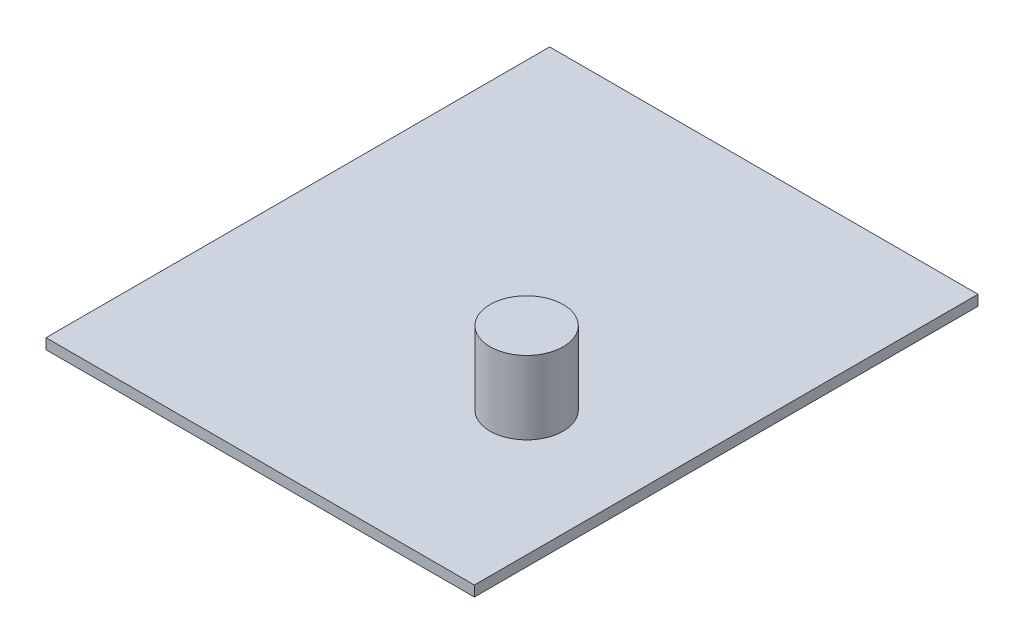
ISO-10303-21;
HEADER;
FILE_DESCRIPTION(('STEP AP214'),'2;1');
FILE_NAME('part.step','',(''),(''),'','','');
FILE_SCHEMA(('AUTOMOTIVE_DESIGN { 1 0 10303 214 1 1 1 1 }'));
ENDSEC;
DATA;
#1=APPLICATION_CONTEXT('core data for automotive mechanical design processes');
#2=APPLICATION_PROTOCOL_DEFINITION('international standard','automotive_design',2000,#1);
#3=PRODUCT_CONTEXT('',#1,'mechanical');
#4=PRODUCT('Part','Part','',(#3));
#5=PRODUCT_RELATED_PRODUCT_CATEGORY('part','',(#4));
#6=PRODUCT_DEFINITION_FORMATION('','',#4);
#7=PRODUCT_DEFINITION_CONTEXT('part definition',#1,'design');
#8=PRODUCT_DEFINITION('design','',#6,#7);
#9=PRODUCT_DEFINITION_SHAPE('','',#8);
#10=(LENGTH_UNIT() NAMED_UNIT(*) SI_UNIT(.MILLI.,.METRE.));
#11=(NAMED_UNIT(*) PLANE_ANGLE_UNIT() SI_UNIT($,.RADIAN.));
#12=(NAMED_UNIT(*) SI_UNIT($,.STERADIAN.) SOLID_ANGLE_UNIT());
#13=UNCERTAINTY_MEASURE_WITH_UNIT(LENGTH_MEASURE(1.E-05),#10,'distance_accuracy_value','');
#14=(GEOMETRIC_REPRESENTATION_CONTEXT(3) GLOBAL_UNCERTAINTY_ASSIGNED_CONTEXT((#13)) GLOBAL_UNIT_ASSIGNED_CONTEXT((#10,
#11,#12)) REPRESENTATION_CONTEXT('',''));
#15=CARTESIAN_POINT('',(0.,0.,0.));
#16=DIRECTION('',(0.,0.,1.));
#17=DIRECTION('',(1.,0.,0.));
#18=AXIS2_PLACEMENT_3D('',#15,#16,#17);
#19=CARTESIAN_POINT('',(-17.6672727272727,1.,-15.9154545454545));
#20=DIRECTION('',(1.,0.,0.));
#21=DIRECTION('',(0.,0.,-1.));
#22=AXIS2_PLACEMENT_3D('',#19,#20,#21);
#23=PLANE('',#22);
#24=DIRECTION('',(0.,0.,1.));
#25=VECTOR('',#24,1.);
#26=CARTESIAN_POINT('',(-17.6672727272727,0.,-15.9154545454545));
#27=LINE('',#26,#25);
#28=CARTESIAN_POINT('',(-17.6672727272727,0.,-15.9154545454545));
#29=VERTEX_POINT('',#28);
#30=CARTESIAN_POINT('',(-17.6672727272727,0.,32.2845454545455));
#31=VERTEX_POINT('',#30);
#32=EDGE_CURVE('E113',#29,#31,#27,.T.);
#33=ORIENTED_EDGE('',*,*,#32,.T.);
#34=DIRECTION('',(0.,-1.,0.));
#35=VECTOR('',#34,1.);
#36=CARTESIAN_POINT('',(-17.6672727272727,1.,32.2845454545455));
#37=LINE('',#36,#35);
#38=CARTESIAN_POINT('',(-17.6672727272727,1.,32.2845454545455));
#39=VERTEX_POINT('',#38);
#40=EDGE_CURVE('E11',#39,#31,#37,.T.);
#41=ORIENTED_EDGE('',*,*,#40,.F.);
#42=DIRECTION('',(0.,0.,1.));
#43=VECTOR('',#42,1.);
#44=CARTESIAN_POINT('',(-17.6672727272727,1.,-15.9154545454545));
#45=LINE('',#44,#43);
#46=CARTESIAN_POINT('',(-17.6672727272727,1.,-15.9154545454545));
#47=VERTEX_POINT('',#46);
#48=EDGE_CURVE('E97',#47,#39,#45,.T.);
#49=ORIENTED_EDGE('',*,*,#48,.F.);
#50=DIRECTION('',(0.,-1.,0.));
#51=VECTOR('',#50,1.);
#52=CARTESIAN_POINT('',(-17.6672727272727,1.,-15.9154545454545));
#53=LINE('',#52,#51);
#54=EDGE_CURVE('E109',#47,#29,#53,.T.);
#55=ORIENTED_EDGE('',*,*,#54,.T.);
#56=EDGE_LOOP('',(#33,#41,#49,#55));
#57=FACE_BOUND('',#56,.T.);
#58=ADVANCED_FACE('F45',(#57),#23,.F.);
#59=CARTESIAN_POINT('',(-17.6672727272727,1.,32.2845454545455));
#60=DIRECTION('',(0.,0.,-1.));
#61=DIRECTION('',(-1.,0.,0.));
#62=AXIS2_PLACEMENT_3D('',#59,#60,#61);
#63=PLANE('',#62);
#64=DIRECTION('',(1.,0.,0.));
#65=VECTOR('',#64,1.);
#66=CARTESIAN_POINT('',(-17.6672727272727,0.,32.2845454545455));
#67=LINE('',#66,#65);
#68=CARTESIAN_POINT('',(23.3327272727273,0.,32.2845454545455));
#69=VERTEX_POINT('',#68);
#70=EDGE_CURVE('E102',#31,#69,#67,.T.);
#71=ORIENTED_EDGE('',*,*,#70,.T.);
#72=DIRECTION('',(0.,-1.,0.));
#73=VECTOR('',#72,1.);
#74=CARTESIAN_POINT('',(23.3327272727273,1.,32.2845454545455));
#75=LINE('',#74,#73);
#76=CARTESIAN_POINT('',(23.3327272727273,1.,32.2845454545455));
#77=VERTEX_POINT('',#76);
#78=EDGE_CURVE('E54',#77,#69,#75,.T.);
#79=ORIENTED_EDGE('',*,*,#78,.F.);
#80=DIRECTION('',(1.,0.,0.));
#81=VECTOR('',#80,1.);
#82=CARTESIAN_POINT('',(-17.6672727272727,1.,32.2845454545455));
#83=LINE('',#82,#81);
#84=EDGE_CURVE('E92',#39,#77,#83,.T.);
#85=ORIENTED_EDGE('',*,*,#84,.F.);
#86=ORIENTED_EDGE('',*,*,#40,.T.);
#87=EDGE_LOOP('',(#71,#79,#85,#86));
#88=FACE_BOUND('',#87,.T.);
#89=ADVANCED_FACE('F101',(#88),#63,.F.);
#90=CARTESIAN_POINT('',(23.3327272727273,1.,-15.9154545454545));
#91=DIRECTION('',(-1.,0.,0.));
#92=DIRECTION('',(0.,0.,1.));
#93=AXIS2_PLACEMENT_3D('',#90,#91,#92);
#94=PLANE('',#93);
#95=DIRECTION('',(0.,0.,-1.));
#96=VECTOR('',#95,1.);
#97=CARTESIAN_POINT('',(23.3327272727273,0.,-15.9154545454545));
#98=LINE('',#97,#96);
#99=CARTESIAN_POINT('',(23.3327272727273,0.,-15.9154545454545));
#100=VERTEX_POINT('',#99);
#101=EDGE_CURVE('E79',#69,#100,#98,.T.);
#102=ORIENTED_EDGE('',*,*,#101,.T.);
#103=DIRECTION('',(0.,-1.,0.));
#104=VECTOR('',#103,1.);
#105=CARTESIAN_POINT('',(23.3327272727273,1.,-15.9154545454545));
#106=LINE('',#105,#104);
#107=CARTESIAN_POINT('',(23.3327272727273,1.,-15.9154545454545));
#108=VERTEX_POINT('',#107);
#109=EDGE_CURVE('E104',#108,#100,#106,.T.);
#110=ORIENTED_EDGE('',*,*,#109,.F.);
#111=DIRECTION('',(0.,0.,-1.));
#112=VECTOR('',#111,1.);
#113=CARTESIAN_POINT('',(23.3327272727273,1.,-15.9154545454545));
#114=LINE('',#113,#112);
#115=EDGE_CURVE('E95',#77,#108,#114,.T.);
#116=ORIENTED_EDGE('',*,*,#115,.F.);
#117=ORIENTED_EDGE('',*,*,#78,.T.);
#118=EDGE_LOOP('',(#102,#110,#116,#117));
#119=FACE_BOUND('',#118,.T.);
#120=ADVANCED_FACE('F105',(#119),#94,.F.);
#121=CARTESIAN_POINT('',(-17.6672727272727,1.,-15.9154545454545));
#122=DIRECTION('',(0.,0.,1.));
#123=DIRECTION('',(1.,0.,0.));
#124=AXIS2_PLACEMENT_3D('',#121,#122,#123);
#125=PLANE('',#124);
#126=DIRECTION('',(-1.,0.,0.));
#127=VECTOR('',#126,1.);
#128=CARTESIAN_POINT('',(-17.6672727272727,0.,-15.9154545454545));
#129=LINE('',#128,#127);
#130=EDGE_CURVE('E85',#100,#29,#129,.T.);
#131=ORIENTED_EDGE('',*,*,#130,.T.);
#132=ORIENTED_EDGE('',*,*,#54,.F.);
#133=DIRECTION('',(-1.,0.,0.));
#134=VECTOR('',#133,1.);
#135=CARTESIAN_POINT('',(-17.6672727272727,1.,-15.9154545454545));
#136=LINE('',#135,#134);
#137=EDGE_CURVE('E62',#108,#47,#136,.T.);
#138=ORIENTED_EDGE('',*,*,#137,.F.);
#139=ORIENTED_EDGE('',*,*,#109,.T.);
#140=EDGE_LOOP('',(#131,#132,#138,#139));
#141=FACE_BOUND('',#140,.T.);
#142=ADVANCED_FACE('F127',(#141),#125,.F.);
#143=CARTESIAN_POINT('',(0.,1.,0.));
#144=DIRECTION('',(0.,1.,0.));
#145=DIRECTION('',(0.,0.,1.));
#146=AXIS2_PLACEMENT_3D('',#143,#144,#145);
#147=PLANE('',#146);
#148=CARTESIAN_POINT('',(11.3327272727273,1.,15.2845454545455));
#149=DIRECTION('',(0.,1.,0.));
#150=DIRECTION('',(0.,0.,1.));
#151=AXIS2_PLACEMENT_3D('',#148,#149,#150);
#152=CIRCLE('',#151,3.5);
#153=CARTESIAN_POINT('',(11.3327272727273,1.,18.7845454545455));
#154=VERTEX_POINT('',#153);
#155=EDGE_CURVE('E134',#154,#154,#152,.T.);
#156=ORIENTED_EDGE('',*,*,#155,.F.);
#157=EDGE_LOOP('',(#156));
#158=FACE_BOUND('',#157,.T.);
#159=ORIENTED_EDGE('',*,*,#48,.T.);
#160=ORIENTED_EDGE('',*,*,#84,.T.);
#161=ORIENTED_EDGE('',*,*,#115,.T.);
#162=ORIENTED_EDGE('',*,*,#137,.T.);
#163=EDGE_LOOP('',(#159,#160,#161,#162));
#164=FACE_BOUND('',#163,.T.);
#165=ADVANCED_FACE('F93',(#158,#164),#147,.T.);
#166=CARTESIAN_POINT('',(0.,0.,0.));
#167=DIRECTION('',(0.,1.,0.));
#168=DIRECTION('',(0.,0.,1.));
#169=AXIS2_PLACEMENT_3D('',#166,#167,#168);
#170=PLANE('',#169);
#171=ORIENTED_EDGE('',*,*,#32,.F.);
#172=ORIENTED_EDGE('',*,*,#130,.F.);
#173=ORIENTED_EDGE('',*,*,#101,.F.);
#174=ORIENTED_EDGE('',*,*,#70,.F.);
#175=EDGE_LOOP('',(#171,#172,#173,#174));
#176=FACE_BOUND('',#175,.T.);
#177=ADVANCED_FACE('F130',(#176),#170,.F.);
#178=CARTESIAN_POINT('',(11.3327272727273,8.,15.2845454545455));
#179=DIRECTION('',(0.,-1.,0.));
#180=DIRECTION('',(0.,0.,-1.));
#181=AXIS2_PLACEMENT_3D('',#178,#179,#180);
#182=CYLINDRICAL_SURFACE('',#181,3.5);
#183=CARTESIAN_POINT('',(11.3327272727273,8.,15.2845454545455));
#184=DIRECTION('',(0.,1.,0.));
#185=DIRECTION('',(0.,0.,1.));
#186=AXIS2_PLACEMENT_3D('',#183,#184,#185);
#187=CIRCLE('',#186,3.5);
#188=CARTESIAN_POINT('',(11.3327272727273,8.,18.7845454545455));
#189=VERTEX_POINT('',#188);
#190=EDGE_CURVE('E117',#189,#189,#187,.T.);
#191=ORIENTED_EDGE('',*,*,#190,.F.);
#192=EDGE_LOOP('',(#191));
#193=FACE_BOUND('',#192,.T.);
#194=ORIENTED_EDGE('',*,*,#155,.T.);
#195=EDGE_LOOP('',(#194));
#196=FACE_BOUND('',#195,.T.);
#197=ADVANCED_FACE('F144',(#193,#196),#182,.T.);
#198=CARTESIAN_POINT('',(11.3327272727273,8.,15.2845454545455));
#199=DIRECTION('',(0.,1.,0.));
#200=DIRECTION('',(0.,0.,1.));
#201=AXIS2_PLACEMENT_3D('',#198,#199,#200);
#202=PLANE('',#201);
#203=ORIENTED_EDGE('',*,*,#190,.T.);
#204=EDGE_LOOP('',(#203));
#205=FACE_BOUND('',#204,.T.);
#206=ADVANCED_FACE('F142',(#205),#202,.T.);
#207=CLOSED_SHELL('',(#58,#89,#120,#142,#165,#177,#197,#206));
#208=MANIFOLD_SOLID_BREP('B2',#207);
#209=ADVANCED_BREP_SHAPE_REPRESENTATION('',(#18,#208),#14);
#210=SHAPE_DEFINITION_REPRESENTATION(#9,#209);
ENDSEC;
END-ISO-10303-21;
